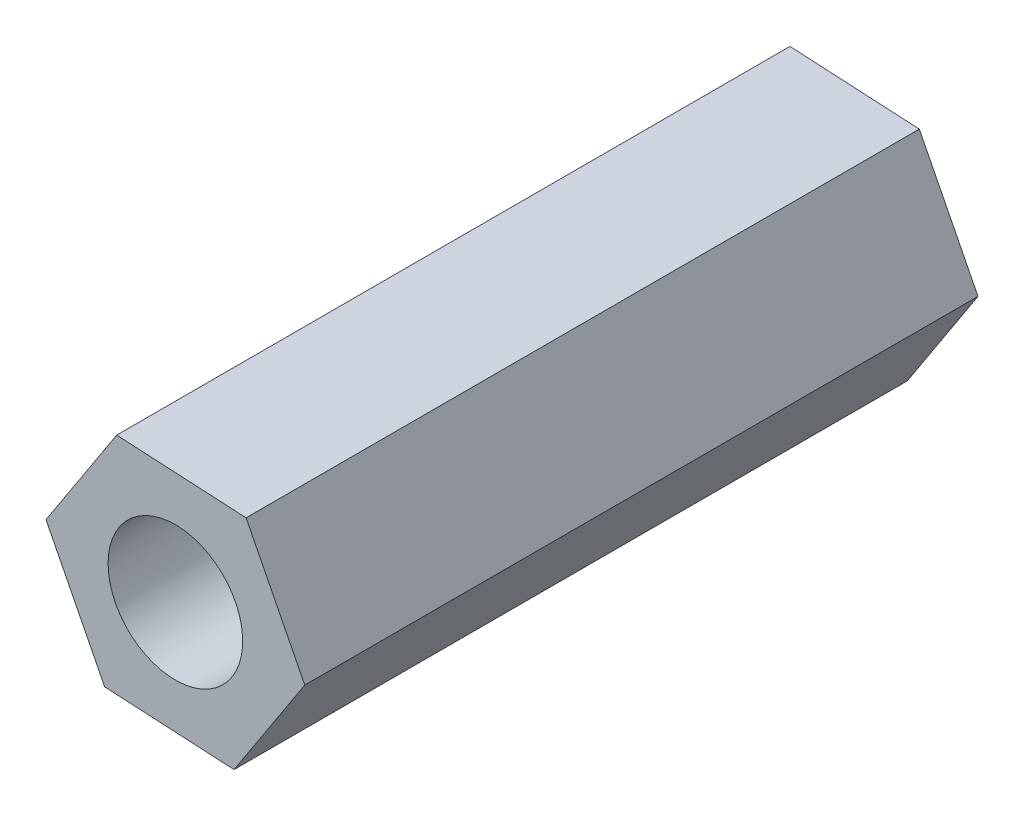
ISO-10303-21;
HEADER;
FILE_DESCRIPTION(('STEP AP214'),'2;1');
FILE_NAME('part.step','',(''),(''),'','','');
FILE_SCHEMA(('AUTOMOTIVE_DESIGN { 1 0 10303 214 1 1 1 1 }'));
ENDSEC;
DATA;
#1=APPLICATION_CONTEXT('core data for automotive mechanical design processes');
#2=APPLICATION_PROTOCOL_DEFINITION('international standard','automotive_design',2000,#1);
#3=PRODUCT_CONTEXT('',#1,'mechanical');
#4=PRODUCT('Part','Part','',(#3));
#5=PRODUCT_RELATED_PRODUCT_CATEGORY('part','',(#4));
#6=PRODUCT_DEFINITION_FORMATION('','',#4);
#7=PRODUCT_DEFINITION_CONTEXT('part definition',#1,'design');
#8=PRODUCT_DEFINITION('design','',#6,#7);
#9=PRODUCT_DEFINITION_SHAPE('','',#8);
#10=(LENGTH_UNIT() NAMED_UNIT(*) SI_UNIT(.MILLI.,.METRE.));
#11=(NAMED_UNIT(*) PLANE_ANGLE_UNIT() SI_UNIT($,.RADIAN.));
#12=(NAMED_UNIT(*) SI_UNIT($,.STERADIAN.) SOLID_ANGLE_UNIT());
#13=UNCERTAINTY_MEASURE_WITH_UNIT(LENGTH_MEASURE(1.E-05),#10,'distance_accuracy_value','');
#14=(GEOMETRIC_REPRESENTATION_CONTEXT(3) GLOBAL_UNCERTAINTY_ASSIGNED_CONTEXT((#13)) GLOBAL_UNIT_ASSIGNED_CONTEXT((#10,
#11,#12)) REPRESENTATION_CONTEXT('',''));
#15=CARTESIAN_POINT('',(0.,0.,0.));
#16=DIRECTION('',(0.,0.,1.));
#17=DIRECTION('',(1.,0.,0.));
#18=AXIS2_PLACEMENT_3D('',#15,#16,#17);
#19=CARTESIAN_POINT('',(2.8825916016709,-0.154916078280261,15.));
#20=DIRECTION('',(-0.891609732350342,-0.452804687672456,0.));
#21=DIRECTION('',(0.452804687672456,-0.891609732350343,0.));
#22=AXIS2_PLACEMENT_3D('',#19,#20,#21);
#23=PLANE('',#22);
#24=DIRECTION('',(-0.452804687672456,0.891609732350342,0.));
#25=VECTOR('',#24,1.);
#26=CARTESIAN_POINT('',(2.8825916016709,-0.154916078280261,0.));
#27=LINE('',#26,#25);
#28=CARTESIAN_POINT('',(2.8825916016709,-0.154916078280261,0.));
#29=VERTEX_POINT('',#28);
#30=CARTESIAN_POINT('',(1.57545706008081,2.41893951664254,0.));
#31=VERTEX_POINT('',#30);
#32=EDGE_CURVE('E115',#29,#31,#27,.T.);
#33=ORIENTED_EDGE('',*,*,#32,.T.);
#34=DIRECTION('',(0.,0.,-1.));
#35=VECTOR('',#34,1.);
#36=CARTESIAN_POINT('',(1.57545706008081,2.41893951664254,15.));
#37=LINE('',#36,#35);
#38=CARTESIAN_POINT('',(1.57545706008081,2.41893951664254,15.));
#39=VERTEX_POINT('',#38);
#40=EDGE_CURVE('E11',#39,#31,#37,.T.);
#41=ORIENTED_EDGE('',*,*,#40,.F.);
#42=DIRECTION('',(-0.452804687672456,0.891609732350342,0.));
#43=VECTOR('',#42,1.);
#44=CARTESIAN_POINT('',(2.8825916016709,-0.154916078280261,15.));
#45=LINE('',#44,#43);
#46=CARTESIAN_POINT('',(2.8825916016709,-0.154916078280261,15.));
#47=VERTEX_POINT('',#46);
#48=EDGE_CURVE('E126',#47,#39,#45,.T.);
#49=ORIENTED_EDGE('',*,*,#48,.F.);
#50=DIRECTION('',(0.,0.,-1.));
#51=VECTOR('',#50,1.);
#52=CARTESIAN_POINT('',(2.8825916016709,-0.154916078280261,15.));
#53=LINE('',#52,#51);
#54=EDGE_CURVE('E111',#47,#29,#53,.T.);
#55=ORIENTED_EDGE('',*,*,#54,.T.);
#56=EDGE_LOOP('',(#33,#41,#49,#55));
#57=FACE_BOUND('',#56,.T.);
#58=ADVANCED_FACE('F31',(#57),#23,.F.);
#59=CARTESIAN_POINT('',(1.57545706008081,2.41893951664254,15.));
#60=DIRECTION('',(-0.0536645036981452,-0.998559022313069,0.));
#61=DIRECTION('',(0.998559022313069,-0.0536645036981453,0.));
#62=AXIS2_PLACEMENT_3D('',#59,#60,#61);
#63=PLANE('',#62);
#64=DIRECTION('',(-0.998559022313069,0.0536645036981452,0.));
#65=VECTOR('',#64,1.);
#66=CARTESIAN_POINT('',(1.57545706008081,2.41893951664254,0.));
#67=LINE('',#66,#65);
#68=CARTESIAN_POINT('',(-1.30713454159008,2.5738555949228,0.));
#69=VERTEX_POINT('',#68);
#70=EDGE_CURVE('E118',#31,#69,#67,.T.);
#71=ORIENTED_EDGE('',*,*,#70,.T.);
#72=DIRECTION('',(0.,0.,-1.));
#73=VECTOR('',#72,1.);
#74=CARTESIAN_POINT('',(-1.30713454159008,2.5738555949228,15.));
#75=LINE('',#74,#73);
#76=CARTESIAN_POINT('',(-1.30713454159008,2.5738555949228,15.));
#77=VERTEX_POINT('',#76);
#78=EDGE_CURVE('E39',#77,#69,#75,.T.);
#79=ORIENTED_EDGE('',*,*,#78,.F.);
#80=DIRECTION('',(-0.998559022313069,0.0536645036981452,0.));
#81=VECTOR('',#80,1.);
#82=CARTESIAN_POINT('',(1.57545706008081,2.41893951664254,15.));
#83=LINE('',#82,#81);
#84=EDGE_CURVE('E84',#39,#77,#83,.T.);
#85=ORIENTED_EDGE('',*,*,#84,.F.);
#86=ORIENTED_EDGE('',*,*,#40,.T.);
#87=EDGE_LOOP('',(#71,#79,#85,#86));
#88=FACE_BOUND('',#87,.T.);
#89=ADVANCED_FACE('F151',(#88),#63,.F.);
#90=CARTESIAN_POINT('',(-1.30713454159008,2.5738555949228,15.));
#91=DIRECTION('',(0.837945228652197,-0.545754334640612,0.));
#92=DIRECTION('',(0.545754334640612,0.837945228652197,0.));
#93=AXIS2_PLACEMENT_3D('',#90,#91,#92);
#94=PLANE('',#93);
#95=DIRECTION('',(-0.545754334640612,-0.837945228652197,0.));
#96=VECTOR('',#95,1.);
#97=CARTESIAN_POINT('',(-1.30713454159008,2.5738555949228,0.));
#98=LINE('',#97,#96);
#99=CARTESIAN_POINT('',(-2.88259160167089,0.154916078280261,0.));
#100=VERTEX_POINT('',#99);
#101=EDGE_CURVE('E121',#69,#100,#98,.T.);
#102=ORIENTED_EDGE('',*,*,#101,.T.);
#103=DIRECTION('',(0.,0.,-1.));
#104=VECTOR('',#103,1.);
#105=CARTESIAN_POINT('',(-2.88259160167089,0.154916078280261,15.));
#106=LINE('',#105,#104);
#107=CARTESIAN_POINT('',(-2.88259160167089,0.154916078280261,15.));
#108=VERTEX_POINT('',#107);
#109=EDGE_CURVE('E106',#108,#100,#106,.T.);
#110=ORIENTED_EDGE('',*,*,#109,.F.);
#111=DIRECTION('',(-0.545754334640612,-0.837945228652197,0.));
#112=VECTOR('',#111,1.);
#113=CARTESIAN_POINT('',(-1.30713454159008,2.5738555949228,15.));
#114=LINE('',#113,#112);
#115=EDGE_CURVE('E97',#77,#108,#114,.T.);
#116=ORIENTED_EDGE('',*,*,#115,.F.);
#117=ORIENTED_EDGE('',*,*,#78,.T.);
#118=EDGE_LOOP('',(#102,#110,#116,#117));
#119=FACE_BOUND('',#118,.T.);
#120=ADVANCED_FACE('F132',(#119),#94,.F.);
#121=CARTESIAN_POINT('',(-2.88259160167089,0.154916078280261,15.));
#122=DIRECTION('',(0.891609732350343,0.452804687672456,0.));
#123=DIRECTION('',(-0.452804687672456,0.891609732350343,0.));
#124=AXIS2_PLACEMENT_3D('',#121,#122,#123);
#125=PLANE('',#124);
#126=DIRECTION('',(0.452804687672456,-0.891609732350343,0.));
#127=VECTOR('',#126,1.);
#128=CARTESIAN_POINT('',(-2.88259160167089,0.154916078280261,0.));
#129=LINE('',#128,#127);
#130=CARTESIAN_POINT('',(-1.57545706008081,-2.41893951664254,0.));
#131=VERTEX_POINT('',#130);
#132=EDGE_CURVE('E105',#100,#131,#129,.T.);
#133=ORIENTED_EDGE('',*,*,#132,.T.);
#134=DIRECTION('',(0.,0.,-1.));
#135=VECTOR('',#134,1.);
#136=CARTESIAN_POINT('',(-1.57545706008081,-2.41893951664254,15.));
#137=LINE('',#136,#135);
#138=CARTESIAN_POINT('',(-1.57545706008081,-2.41893951664254,15.));
#139=VERTEX_POINT('',#138);
#140=EDGE_CURVE('E102',#139,#131,#137,.T.);
#141=ORIENTED_EDGE('',*,*,#140,.F.);
#142=DIRECTION('',(0.452804687672456,-0.891609732350343,0.));
#143=VECTOR('',#142,1.);
#144=CARTESIAN_POINT('',(-2.88259160167089,0.154916078280261,15.));
#145=LINE('',#144,#143);
#146=EDGE_CURVE('E91',#108,#139,#145,.T.);
#147=ORIENTED_EDGE('',*,*,#146,.F.);
#148=ORIENTED_EDGE('',*,*,#109,.T.);
#149=EDGE_LOOP('',(#133,#141,#147,#148));
#150=FACE_BOUND('',#149,.T.);
#151=ADVANCED_FACE('F103',(#150),#125,.F.);
#152=CARTESIAN_POINT('',(-1.57545706008081,-2.41893951664254,15.));
#153=DIRECTION('',(0.0536645036981452,0.998559022313069,0.));
#154=DIRECTION('',(-0.998559022313069,0.0536645036981452,0.));
#155=AXIS2_PLACEMENT_3D('',#152,#153,#154);
#156=PLANE('',#155);
#157=DIRECTION('',(0.998559022313069,-0.0536645036981452,0.));
#158=VECTOR('',#157,1.);
#159=CARTESIAN_POINT('',(-1.57545706008081,-2.41893951664254,0.));
#160=LINE('',#159,#158);
#161=CARTESIAN_POINT('',(1.30713454159009,-2.5738555949228,0.));
#162=VERTEX_POINT('',#161);
#163=EDGE_CURVE('E70',#131,#162,#160,.T.);
#164=ORIENTED_EDGE('',*,*,#163,.T.);
#165=DIRECTION('',(0.,0.,-1.));
#166=VECTOR('',#165,1.);
#167=CARTESIAN_POINT('',(1.30713454159009,-2.5738555949228,15.));
#168=LINE('',#167,#166);
#169=CARTESIAN_POINT('',(1.30713454159009,-2.5738555949228,15.));
#170=VERTEX_POINT('',#169);
#171=EDGE_CURVE('E107',#170,#162,#168,.T.);
#172=ORIENTED_EDGE('',*,*,#171,.F.);
#173=DIRECTION('',(0.998559022313069,-0.0536645036981452,0.));
#174=VECTOR('',#173,1.);
#175=CARTESIAN_POINT('',(-1.57545706008081,-2.41893951664254,15.));
#176=LINE('',#175,#174);
#177=EDGE_CURVE('E95',#139,#170,#176,.T.);
#178=ORIENTED_EDGE('',*,*,#177,.F.);
#179=ORIENTED_EDGE('',*,*,#140,.T.);
#180=EDGE_LOOP('',(#164,#172,#178,#179));
#181=FACE_BOUND('',#180,.T.);
#182=ADVANCED_FACE('F109',(#181),#156,.F.);
#183=CARTESIAN_POINT('',(1.30713454159009,-2.5738555949228,15.));
#184=DIRECTION('',(-0.837945228652197,0.545754334640612,0.));
#185=DIRECTION('',(-0.545754334640612,-0.837945228652197,0.));
#186=AXIS2_PLACEMENT_3D('',#183,#184,#185);
#187=PLANE('',#186);
#188=DIRECTION('',(0.545754334640612,0.837945228652197,0.));
#189=VECTOR('',#188,1.);
#190=CARTESIAN_POINT('',(1.30713454159009,-2.5738555949228,0.));
#191=LINE('',#190,#189);
#192=EDGE_CURVE('E76',#162,#29,#191,.T.);
#193=ORIENTED_EDGE('',*,*,#192,.T.);
#194=ORIENTED_EDGE('',*,*,#54,.F.);
#195=DIRECTION('',(0.545754334640612,0.837945228652197,0.));
#196=VECTOR('',#195,1.);
#197=CARTESIAN_POINT('',(1.30713454159009,-2.5738555949228,15.));
#198=LINE('',#197,#196);
#199=EDGE_CURVE('E47',#170,#47,#198,.T.);
#200=ORIENTED_EDGE('',*,*,#199,.F.);
#201=ORIENTED_EDGE('',*,*,#171,.T.);
#202=EDGE_LOOP('',(#193,#194,#200,#201));
#203=FACE_BOUND('',#202,.T.);
#204=ADVANCED_FACE('F139',(#203),#187,.F.);
#205=CARTESIAN_POINT('',(1.57545706008081,2.41893951664254,15.));
#206=DIRECTION('',(0.,0.,1.));
#207=DIRECTION('',(1.,0.,0.));
#208=AXIS2_PLACEMENT_3D('',#205,#206,#207);
#209=PLANE('',#208);
#210=CARTESIAN_POINT('',(0.,0.,15.));
#211=DIRECTION('',(0.,0.,-1.));
#212=DIRECTION('',(-1.,0.,0.));
#213=AXIS2_PLACEMENT_3D('',#210,#211,#212);
#214=CIRCLE('',#213,1.5);
#215=CARTESIAN_POINT('',(-1.5,0.,15.));
#216=VERTEX_POINT('',#215);
#217=EDGE_CURVE('E119',#216,#216,#214,.T.);
#218=ORIENTED_EDGE('',*,*,#217,.T.);
#219=EDGE_LOOP('',(#218));
#220=FACE_BOUND('',#219,.T.);
#221=ORIENTED_EDGE('',*,*,#48,.T.);
#222=ORIENTED_EDGE('',*,*,#84,.T.);
#223=ORIENTED_EDGE('',*,*,#115,.T.);
#224=ORIENTED_EDGE('',*,*,#146,.T.);
#225=ORIENTED_EDGE('',*,*,#177,.T.);
#226=ORIENTED_EDGE('',*,*,#199,.T.);
#227=EDGE_LOOP('',(#221,#222,#223,#224,#225,#226));
#228=FACE_BOUND('',#227,.T.);
#229=ADVANCED_FACE('F93',(#220,#228),#209,.T.);
#230=CARTESIAN_POINT('',(1.57545706008081,2.41893951664254,0.));
#231=DIRECTION('',(0.,0.,1.));
#232=DIRECTION('',(1.,0.,0.));
#233=AXIS2_PLACEMENT_3D('',#230,#231,#232);
#234=PLANE('',#233);
#235=CARTESIAN_POINT('',(0.,0.,0.));
#236=DIRECTION('',(0.,0.,-1.));
#237=DIRECTION('',(-1.,0.,0.));
#238=AXIS2_PLACEMENT_3D('',#235,#236,#237);
#239=CIRCLE('',#238,1.5);
#240=CARTESIAN_POINT('',(-1.5,0.,0.));
#241=VERTEX_POINT('',#240);
#242=EDGE_CURVE('E206',#241,#241,#239,.T.);
#243=ORIENTED_EDGE('',*,*,#242,.F.);
#244=EDGE_LOOP('',(#243));
#245=FACE_BOUND('',#244,.T.);
#246=ORIENTED_EDGE('',*,*,#32,.F.);
#247=ORIENTED_EDGE('',*,*,#192,.F.);
#248=ORIENTED_EDGE('',*,*,#163,.F.);
#249=ORIENTED_EDGE('',*,*,#132,.F.);
#250=ORIENTED_EDGE('',*,*,#101,.F.);
#251=ORIENTED_EDGE('',*,*,#70,.F.);
#252=EDGE_LOOP('',(#246,#247,#248,#249,#250,#251));
#253=FACE_BOUND('',#252,.T.);
#254=ADVANCED_FACE('F135',(#245,#253),#234,.F.);
#255=CARTESIAN_POINT('',(0.,0.,15.));
#256=DIRECTION('',(0.,0.,-1.));
#257=DIRECTION('',(-1.,0.,0.));
#258=AXIS2_PLACEMENT_3D('',#255,#256,#257);
#259=CYLINDRICAL_SURFACE('',#258,1.5);
#260=ORIENTED_EDGE('',*,*,#217,.F.);
#261=EDGE_LOOP('',(#260));
#262=FACE_BOUND('',#261,.T.);
#263=ORIENTED_EDGE('',*,*,#242,.T.);
#264=EDGE_LOOP('',(#263));
#265=FACE_BOUND('',#264,.T.);
#266=ADVANCED_FACE('F188',(#262,#265),#259,.F.);
#267=CLOSED_SHELL('',(#58,#89,#120,#151,#182,#204,#229,#254,#266));
#268=MANIFOLD_SOLID_BREP('B2',#267);
#269=ADVANCED_BREP_SHAPE_REPRESENTATION('',(#18,#268),#14);
#270=SHAPE_DEFINITION_REPRESENTATION(#9,#269);
ENDSEC;
END-ISO-10303-21;
